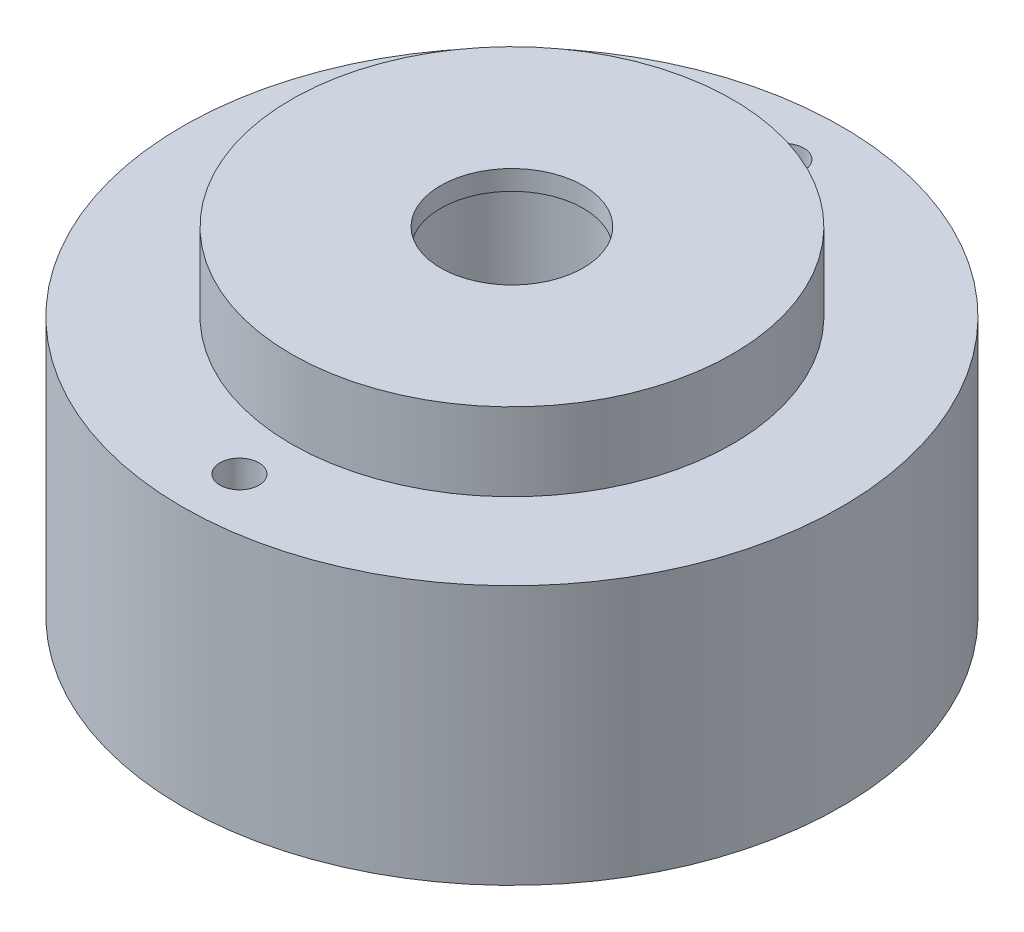
ISO-10303-21;
HEADER;
FILE_DESCRIPTION(('STEP AP214'),'2;1');
FILE_NAME('part.step','',(''),(''),'','','');
FILE_SCHEMA(('AUTOMOTIVE_DESIGN { 1 0 10303 214 1 1 1 1 }'));
ENDSEC;
DATA;
#1=APPLICATION_CONTEXT('core data for automotive mechanical design processes');
#2=APPLICATION_PROTOCOL_DEFINITION('international standard','automotive_design',2000,#1);
#3=PRODUCT_CONTEXT('',#1,'mechanical');
#4=PRODUCT('Part','Part','',(#3));
#5=PRODUCT_RELATED_PRODUCT_CATEGORY('part','',(#4));
#6=PRODUCT_DEFINITION_FORMATION('','',#4);
#7=PRODUCT_DEFINITION_CONTEXT('part definition',#1,'design');
#8=PRODUCT_DEFINITION('design','',#6,#7);
#9=PRODUCT_DEFINITION_SHAPE('','',#8);
#10=(LENGTH_UNIT() NAMED_UNIT(*) SI_UNIT(.MILLI.,.METRE.));
#11=(NAMED_UNIT(*) PLANE_ANGLE_UNIT() SI_UNIT($,.RADIAN.));
#12=(NAMED_UNIT(*) SI_UNIT($,.STERADIAN.) SOLID_ANGLE_UNIT());
#13=UNCERTAINTY_MEASURE_WITH_UNIT(LENGTH_MEASURE(1.E-05),#10,'distance_accuracy_value','');
#14=(GEOMETRIC_REPRESENTATION_CONTEXT(3) GLOBAL_UNCERTAINTY_ASSIGNED_CONTEXT((#13)) GLOBAL_UNIT_ASSIGNED_CONTEXT((#10,
#11,#12)) REPRESENTATION_CONTEXT('',''));
#15=CARTESIAN_POINT('',(0.,0.,0.));
#16=DIRECTION('',(0.,0.,1.));
#17=DIRECTION('',(1.,0.,0.));
#18=AXIS2_PLACEMENT_3D('',#15,#16,#17);
#19=CARTESIAN_POINT('',(0.,13.,0.));
#20=DIRECTION('',(0.,1.,0.));
#21=DIRECTION('',(0.,0.,1.));
#22=AXIS2_PLACEMENT_3D('',#19,#20,#21);
#23=PLANE('',#22);
#24=CARTESIAN_POINT('',(0.,13.,0.));
#25=DIRECTION('',(0.,1.,0.));
#26=DIRECTION('',(0.,0.,1.));
#27=AXIS2_PLACEMENT_3D('',#24,#25,#26);
#28=CIRCLE('',#27,8.5);
#29=CARTESIAN_POINT('',(0.,13.,8.5));
#30=VERTEX_POINT('',#29);
#31=EDGE_CURVE('E90',#30,#30,#28,.T.);
#32=ORIENTED_EDGE('',*,*,#31,.T.);
#33=EDGE_LOOP('',(#32));
#34=FACE_BOUND('',#33,.T.);
#35=CARTESIAN_POINT('',(0.,13.,0.));
#36=DIRECTION('',(0.,-1.,0.));
#37=DIRECTION('',(0.,0.,-1.));
#38=AXIS2_PLACEMENT_3D('',#35,#36,#37);
#39=CIRCLE('',#38,2.75);
#40=CARTESIAN_POINT('',(0.,13.,-2.75));
#41=VERTEX_POINT('',#40);
#42=EDGE_CURVE('E87',#41,#41,#39,.T.);
#43=ORIENTED_EDGE('',*,*,#42,.T.);
#44=EDGE_LOOP('',(#43));
#45=FACE_BOUND('',#44,.T.);
#46=ADVANCED_FACE('F44',(#34,#45),#23,.T.);
#47=CARTESIAN_POINT('',(0.,10.,0.));
#48=DIRECTION('',(0.,-1.,0.));
#49=DIRECTION('',(0.,0.,-1.));
#50=AXIS2_PLACEMENT_3D('',#47,#48,#49);
#51=CYLINDRICAL_SURFACE('',#50,12.7);
#52=CARTESIAN_POINT('',(0.,10.,0.));
#53=DIRECTION('',(0.,1.,0.));
#54=DIRECTION('',(0.,0.,1.));
#55=AXIS2_PLACEMENT_3D('',#52,#53,#54);
#56=CIRCLE('',#55,12.7);
#57=CARTESIAN_POINT('',(0.,10.,12.7));
#58=VERTEX_POINT('',#57);
#59=EDGE_CURVE('E53',#58,#58,#56,.T.);
#60=ORIENTED_EDGE('',*,*,#59,.F.);
#61=EDGE_LOOP('',(#60));
#62=FACE_BOUND('',#61,.T.);
#63=CARTESIAN_POINT('',(0.,0.,0.));
#64=DIRECTION('',(0.,1.,0.));
#65=DIRECTION('',(0.,0.,1.));
#66=AXIS2_PLACEMENT_3D('',#63,#64,#65);
#67=CIRCLE('',#66,12.7);
#68=CARTESIAN_POINT('',(0.,0.,12.7));
#69=VERTEX_POINT('',#68);
#70=EDGE_CURVE('E92',#69,#69,#67,.T.);
#71=ORIENTED_EDGE('',*,*,#70,.T.);
#72=EDGE_LOOP('',(#71));
#73=FACE_BOUND('',#72,.T.);
#74=ADVANCED_FACE('F46',(#62,#73),#51,.T.);
#75=CARTESIAN_POINT('',(0.,10.,0.));
#76=DIRECTION('',(0.,1.,0.));
#77=DIRECTION('',(0.,0.,1.));
#78=AXIS2_PLACEMENT_3D('',#75,#76,#77);
#79=PLANE('',#78);
#80=CARTESIAN_POINT('',(0.,10.,-10.5));
#81=DIRECTION('',(0.,1.,0.));
#82=DIRECTION('',(0.,0.,1.));
#83=AXIS2_PLACEMENT_3D('',#80,#81,#82);
#84=CIRCLE('',#83,0.75);
#85=CARTESIAN_POINT('',(0.,10.,-9.75));
#86=VERTEX_POINT('',#85);
#87=EDGE_CURVE('E71',#86,#86,#84,.T.);
#88=ORIENTED_EDGE('',*,*,#87,.F.);
#89=EDGE_LOOP('',(#88));
#90=FACE_BOUND('',#89,.T.);
#91=CARTESIAN_POINT('',(0.,10.,10.5));
#92=DIRECTION('',(0.,1.,0.));
#93=DIRECTION('',(0.,0.,1.));
#94=AXIS2_PLACEMENT_3D('',#91,#92,#93);
#95=CIRCLE('',#94,0.75);
#96=CARTESIAN_POINT('',(0.,10.,11.25));
#97=VERTEX_POINT('',#96);
#98=EDGE_CURVE('E70',#97,#97,#95,.T.);
#99=ORIENTED_EDGE('',*,*,#98,.F.);
#100=EDGE_LOOP('',(#99));
#101=FACE_BOUND('',#100,.T.);
#102=CARTESIAN_POINT('',(0.,10.,0.));
#103=DIRECTION('',(0.,1.,0.));
#104=DIRECTION('',(0.,0.,1.));
#105=AXIS2_PLACEMENT_3D('',#102,#103,#104);
#106=CIRCLE('',#105,8.5);
#107=CARTESIAN_POINT('',(0.,10.,8.5));
#108=VERTEX_POINT('',#107);
#109=EDGE_CURVE('E13',#108,#108,#106,.T.);
#110=ORIENTED_EDGE('',*,*,#109,.F.);
#111=EDGE_LOOP('',(#110));
#112=FACE_BOUND('',#111,.T.);
#113=ORIENTED_EDGE('',*,*,#59,.T.);
#114=EDGE_LOOP('',(#113));
#115=FACE_BOUND('',#114,.T.);
#116=ADVANCED_FACE('F102',(#90,#101,#112,#115),#79,.T.);
#117=CARTESIAN_POINT('',(0.,0.,0.));
#118=DIRECTION('',(0.,1.,0.));
#119=DIRECTION('',(0.,0.,1.));
#120=AXIS2_PLACEMENT_3D('',#117,#118,#119);
#121=PLANE('',#120);
#122=CARTESIAN_POINT('',(0.,0.,0.));
#123=DIRECTION('',(0.,-1.,0.));
#124=DIRECTION('',(0.,0.,-1.));
#125=AXIS2_PLACEMENT_3D('',#122,#123,#124);
#126=CIRCLE('',#125,3.14999999999999);
#127=CARTESIAN_POINT('',(0.,0.,-3.14999999999999));
#128=VERTEX_POINT('',#127);
#129=EDGE_CURVE('E81',#128,#128,#126,.T.);
#130=ORIENTED_EDGE('',*,*,#129,.F.);
#131=EDGE_LOOP('',(#130));
#132=FACE_BOUND('',#131,.T.);
#133=ORIENTED_EDGE('',*,*,#70,.F.);
#134=EDGE_LOOP('',(#133));
#135=FACE_BOUND('',#134,.T.);
#136=ADVANCED_FACE('F99',(#132,#135),#121,.F.);
#137=CARTESIAN_POINT('',(0.,13.,0.));
#138=DIRECTION('',(0.,-1.,0.));
#139=DIRECTION('',(0.,0.,-1.));
#140=AXIS2_PLACEMENT_3D('',#137,#138,#139);
#141=CYLINDRICAL_SURFACE('',#140,8.5);
#142=ORIENTED_EDGE('',*,*,#31,.F.);
#143=EDGE_LOOP('',(#142));
#144=FACE_BOUND('',#143,.T.);
#145=ORIENTED_EDGE('',*,*,#109,.T.);
#146=EDGE_LOOP('',(#145));
#147=FACE_BOUND('',#146,.T.);
#148=ADVANCED_FACE('F101',(#144,#147),#141,.T.);
#149=CARTESIAN_POINT('',(0.,0.,0.));
#150=DIRECTION('',(0.,-1.,0.));
#151=DIRECTION('',(0.,0.,-1.));
#152=AXIS2_PLACEMENT_3D('',#149,#150,#151);
#153=CYLINDRICAL_SURFACE('',#152,2.75);
#154=CARTESIAN_POINT('',(0.,12.240344247611,0.));
#155=DIRECTION('',(0.,-1.,0.));
#156=DIRECTION('',(0.,0.,-1.));
#157=AXIS2_PLACEMENT_3D('',#154,#155,#156);
#158=CIRCLE('',#157,2.75);
#159=CARTESIAN_POINT('',(0.,12.240344247611,-2.75));
#160=VERTEX_POINT('',#159);
#161=EDGE_CURVE('E48',#160,#160,#158,.T.);
#162=ORIENTED_EDGE('',*,*,#161,.T.);
#163=EDGE_LOOP('',(#162));
#164=FACE_BOUND('',#163,.T.);
#165=ORIENTED_EDGE('',*,*,#42,.F.);
#166=EDGE_LOOP('',(#165));
#167=FACE_BOUND('',#166,.T.);
#168=ADVANCED_FACE('F108',(#164,#167),#153,.F.);
#169=CARTESIAN_POINT('',(0.,12.,0.));
#170=DIRECTION('',(0.,-1.,0.));
#171=DIRECTION('',(0.,0.,-1.));
#172=AXIS2_PLACEMENT_3D('',#169,#170,#171);
#173=CONICAL_SURFACE('',#172,3.15,1.02974425867665);
#174=CARTESIAN_POINT('',(0.,12.,0.));
#175=DIRECTION('',(0.,-1.,0.));
#176=DIRECTION('',(0.,0.,-1.));
#177=AXIS2_PLACEMENT_3D('',#174,#175,#176);
#178=CIRCLE('',#177,3.15);
#179=CARTESIAN_POINT('',(0.,12.,-3.15));
#180=VERTEX_POINT('',#179);
#181=EDGE_CURVE('E84',#180,#180,#178,.T.);
#182=ORIENTED_EDGE('',*,*,#181,.T.);
#183=EDGE_LOOP('',(#182));
#184=FACE_BOUND('',#183,.T.);
#185=ORIENTED_EDGE('',*,*,#161,.F.);
#186=EDGE_LOOP('',(#185));
#187=FACE_BOUND('',#186,.T.);
#188=ADVANCED_FACE('F125',(#184,#187),#173,.F.);
#189=CARTESIAN_POINT('',(0.,0.,0.));
#190=DIRECTION('',(0.,-1.,0.));
#191=DIRECTION('',(0.,0.,-1.));
#192=AXIS2_PLACEMENT_3D('',#189,#190,#191);
#193=CYLINDRICAL_SURFACE('',#192,3.14999999999999);
#194=ORIENTED_EDGE('',*,*,#181,.F.);
#195=EDGE_LOOP('',(#194));
#196=FACE_BOUND('',#195,.T.);
#197=ORIENTED_EDGE('',*,*,#129,.T.);
#198=EDGE_LOOP('',(#197));
#199=FACE_BOUND('',#198,.T.);
#200=ADVANCED_FACE('F129',(#196,#199),#193,.F.);
#201=CARTESIAN_POINT('',(0.,7.,10.5));
#202=DIRECTION('',(0.,1.,0.));
#203=DIRECTION('',(0.,0.,1.));
#204=AXIS2_PLACEMENT_3D('',#201,#202,#203);
#205=CONICAL_SURFACE('',#204,0.749999999999999,1.02974425867665);
#206=CARTESIAN_POINT('',(0.,6.54935453572933,10.5));
#207=VERTEX_POINT('',#206);
#208=VERTEX_LOOP('',#207);
#209=FACE_BOUND('',#208,.T.);
#210=CARTESIAN_POINT('',(0.,7.,10.5));
#211=DIRECTION('',(0.,1.,0.));
#212=DIRECTION('',(0.,0.,1.));
#213=AXIS2_PLACEMENT_3D('',#210,#211,#212);
#214=CIRCLE('',#213,0.749999999999999);
#215=CARTESIAN_POINT('',(0.,7.,11.25));
#216=VERTEX_POINT('',#215);
#217=EDGE_CURVE('E74',#216,#216,#214,.T.);
#218=ORIENTED_EDGE('',*,*,#217,.T.);
#219=EDGE_LOOP('',(#218));
#220=FACE_BOUND('',#219,.T.);
#221=ADVANCED_FACE('F133',(#209,#220),#205,.F.);
#222=CARTESIAN_POINT('',(0.,10.,10.5));
#223=DIRECTION('',(0.,1.,0.));
#224=DIRECTION('',(0.,0.,1.));
#225=AXIS2_PLACEMENT_3D('',#222,#223,#224);
#226=CYLINDRICAL_SURFACE('',#225,0.749999999999999);
#227=ORIENTED_EDGE('',*,*,#217,.F.);
#228=EDGE_LOOP('',(#227));
#229=FACE_BOUND('',#228,.T.);
#230=ORIENTED_EDGE('',*,*,#98,.T.);
#231=EDGE_LOOP('',(#230));
#232=FACE_BOUND('',#231,.T.);
#233=ADVANCED_FACE('F64',(#229,#232),#226,.F.);
#234=CARTESIAN_POINT('',(0.,7.,-10.5));
#235=DIRECTION('',(0.,1.,0.));
#236=DIRECTION('',(0.,0.,1.));
#237=AXIS2_PLACEMENT_3D('',#234,#235,#236);
#238=CONICAL_SURFACE('',#237,0.749999999999999,1.02974425867665);
#239=CARTESIAN_POINT('',(0.,6.54935453572933,-10.5));
#240=VERTEX_POINT('',#239);
#241=VERTEX_LOOP('',#240);
#242=FACE_BOUND('',#241,.T.);
#243=CARTESIAN_POINT('',(0.,7.,-10.5));
#244=DIRECTION('',(0.,1.,0.));
#245=DIRECTION('',(0.,0.,1.));
#246=AXIS2_PLACEMENT_3D('',#243,#244,#245);
#247=CIRCLE('',#246,0.749999999999999);
#248=CARTESIAN_POINT('',(0.,7.,-9.75));
#249=VERTEX_POINT('',#248);
#250=EDGE_CURVE('E68',#249,#249,#247,.T.);
#251=ORIENTED_EDGE('',*,*,#250,.T.);
#252=EDGE_LOOP('',(#251));
#253=FACE_BOUND('',#252,.T.);
#254=ADVANCED_FACE('F60',(#242,#253),#238,.F.);
#255=CARTESIAN_POINT('',(0.,10.,-10.5));
#256=DIRECTION('',(0.,1.,0.));
#257=DIRECTION('',(0.,0.,1.));
#258=AXIS2_PLACEMENT_3D('',#255,#256,#257);
#259=CYLINDRICAL_SURFACE('',#258,0.749999999999999);
#260=ORIENTED_EDGE('',*,*,#250,.F.);
#261=EDGE_LOOP('',(#260));
#262=FACE_BOUND('',#261,.T.);
#263=ORIENTED_EDGE('',*,*,#87,.T.);
#264=EDGE_LOOP('',(#263));
#265=FACE_BOUND('',#264,.T.);
#266=ADVANCED_FACE('F63',(#262,#265),#259,.F.);
#267=CLOSED_SHELL('',(#46,#74,#116,#136,#148,#168,#188,#200,#221,#233,#254,#266));
#268=MANIFOLD_SOLID_BREP('B2',#267);
#269=ADVANCED_BREP_SHAPE_REPRESENTATION('',(#18,#268),#14);
#270=SHAPE_DEFINITION_REPRESENTATION(#9,#269);
ENDSEC;
END-ISO-10303-21;
